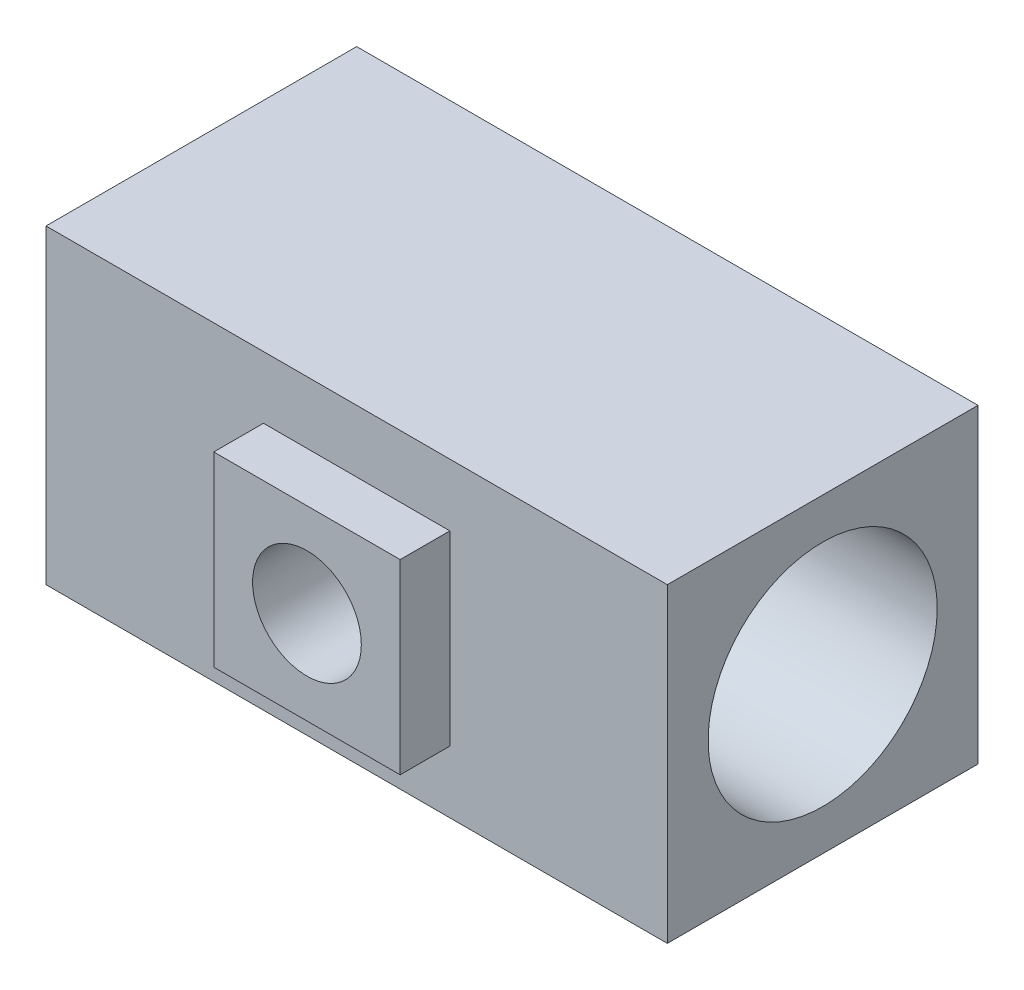
ISO-10303-21;
HEADER;
FILE_DESCRIPTION(('STEP AP214'),'2;1');
FILE_NAME('part.step','',(''),(''),'','','');
FILE_SCHEMA(('AUTOMOTIVE_DESIGN { 1 0 10303 214 1 1 1 1 }'));
ENDSEC;
DATA;
#1=APPLICATION_CONTEXT('core data for automotive mechanical design processes');
#2=APPLICATION_PROTOCOL_DEFINITION('international standard','automotive_design',2000,#1);
#3=PRODUCT_CONTEXT('',#1,'mechanical');
#4=PRODUCT('Part','Part','',(#3));
#5=PRODUCT_RELATED_PRODUCT_CATEGORY('part','',(#4));
#6=PRODUCT_DEFINITION_FORMATION('','',#4);
#7=PRODUCT_DEFINITION_CONTEXT('part definition',#1,'design');
#8=PRODUCT_DEFINITION('design','',#6,#7);
#9=PRODUCT_DEFINITION_SHAPE('','',#8);
#10=(LENGTH_UNIT() NAMED_UNIT(*) SI_UNIT(.MILLI.,.METRE.));
#11=(NAMED_UNIT(*) PLANE_ANGLE_UNIT() SI_UNIT($,.RADIAN.));
#12=(NAMED_UNIT(*) SI_UNIT($,.STERADIAN.) SOLID_ANGLE_UNIT());
#13=UNCERTAINTY_MEASURE_WITH_UNIT(LENGTH_MEASURE(1.E-05),#10,'distance_accuracy_value','');
#14=(GEOMETRIC_REPRESENTATION_CONTEXT(3) GLOBAL_UNCERTAINTY_ASSIGNED_CONTEXT((#13)) GLOBAL_UNIT_ASSIGNED_CONTEXT((#10,
#11,#12)) REPRESENTATION_CONTEXT('',''));
#15=CARTESIAN_POINT('',(0.,0.,0.));
#16=DIRECTION('',(0.,0.,1.));
#17=DIRECTION('',(1.,0.,0.));
#18=AXIS2_PLACEMENT_3D('',#15,#16,#17);
#19=CARTESIAN_POINT('',(0.,31.75,15.875));
#20=DIRECTION('',(0.,0.,-1.));
#21=DIRECTION('',(-1.,0.,0.));
#22=AXIS2_PLACEMENT_3D('',#19,#20,#21);
#23=PLANE('',#22);
#24=DIRECTION('',(1.,0.,0.));
#25=VECTOR('',#24,1.);
#26=CARTESIAN_POINT('',(0.,0.,15.875));
#27=LINE('',#26,#25);
#28=CARTESIAN_POINT('',(-31.75,0.,15.875));
#29=VERTEX_POINT('',#28);
#30=CARTESIAN_POINT('',(31.75,0.,15.875));
#31=VERTEX_POINT('',#30);
#32=EDGE_CURVE('E154',#29,#31,#27,.T.);
#33=ORIENTED_EDGE('',*,*,#32,.T.);
#34=DIRECTION('',(0.,-1.,0.));
#35=VECTOR('',#34,1.);
#36=CARTESIAN_POINT('',(31.75,31.75,15.875));
#37=LINE('',#36,#35);
#38=CARTESIAN_POINT('',(31.75,31.75,15.875));
#39=VERTEX_POINT('',#38);
#40=EDGE_CURVE('E11',#39,#31,#37,.T.);
#41=ORIENTED_EDGE('',*,*,#40,.F.);
#42=DIRECTION('',(1.,0.,0.));
#43=VECTOR('',#42,1.);
#44=CARTESIAN_POINT('',(0.,31.75,15.875));
#45=LINE('',#44,#43);
#46=CARTESIAN_POINT('',(-31.75,31.75,15.875));
#47=VERTEX_POINT('',#46);
#48=EDGE_CURVE('E155',#47,#39,#45,.T.);
#49=ORIENTED_EDGE('',*,*,#48,.F.);
#50=DIRECTION('',(0.,-1.,0.));
#51=VECTOR('',#50,1.);
#52=CARTESIAN_POINT('',(-31.75,31.75,15.875));
#53=LINE('',#52,#51);
#54=EDGE_CURVE('E171',#47,#29,#53,.T.);
#55=ORIENTED_EDGE('',*,*,#54,.T.);
#56=EDGE_LOOP('',(#33,#41,#49,#55));
#57=FACE_BOUND('',#56,.T.);
#58=DIRECTION('',(1.,0.,0.));
#59=VECTOR('',#58,1.);
#60=CARTESIAN_POINT('',(0.,6.35,15.875));
#61=LINE('',#60,#59);
#62=CARTESIAN_POINT('',(-9.525,6.35,15.875));
#63=VERTEX_POINT('',#62);
#64=CARTESIAN_POINT('',(9.525,6.35,15.875));
#65=VERTEX_POINT('',#64);
#66=EDGE_CURVE('E66',#63,#65,#61,.T.);
#67=ORIENTED_EDGE('',*,*,#66,.F.);
#68=DIRECTION('',(0.,1.,0.));
#69=VECTOR('',#68,1.);
#70=CARTESIAN_POINT('',(-9.525,0.,15.875));
#71=LINE('',#70,#69);
#72=CARTESIAN_POINT('',(-9.525,25.4,15.875));
#73=VERTEX_POINT('',#72);
#74=EDGE_CURVE('E71',#63,#73,#71,.T.);
#75=ORIENTED_EDGE('',*,*,#74,.T.);
#76=DIRECTION('',(1.,0.,0.));
#77=VECTOR('',#76,1.);
#78=CARTESIAN_POINT('',(0.,25.4,15.875));
#79=LINE('',#78,#77);
#80=CARTESIAN_POINT('',(9.525,25.4,15.875));
#81=VERTEX_POINT('',#80);
#82=EDGE_CURVE('E273',#73,#81,#79,.T.);
#83=ORIENTED_EDGE('',*,*,#82,.T.);
#84=DIRECTION('',(0.,1.,0.));
#85=VECTOR('',#84,1.);
#86=CARTESIAN_POINT('',(9.525,0.,15.875));
#87=LINE('',#86,#85);
#88=EDGE_CURVE('E262',#65,#81,#87,.T.);
#89=ORIENTED_EDGE('',*,*,#88,.F.);
#90=EDGE_LOOP('',(#67,#75,#83,#89));
#91=FACE_BOUND('',#90,.T.);
#92=ADVANCED_FACE('F45',(#57,#91),#23,.F.);
#93=CARTESIAN_POINT('',(31.75,31.75,0.));
#94=DIRECTION('',(-1.,0.,0.));
#95=DIRECTION('',(0.,0.,1.));
#96=AXIS2_PLACEMENT_3D('',#93,#94,#95);
#97=PLANE('',#96);
#98=CARTESIAN_POINT('',(31.75,15.875,0.));
#99=DIRECTION('',(1.,0.,0.));
#100=DIRECTION('',(0.,0.,-1.));
#101=AXIS2_PLACEMENT_3D('',#98,#99,#100);
#102=CIRCLE('',#101,11.707876);
#103=CARTESIAN_POINT('',(31.75,15.875,-11.707876));
#104=VERTEX_POINT('',#103);
#105=EDGE_CURVE('E140',#104,#104,#102,.T.);
#106=ORIENTED_EDGE('',*,*,#105,.F.);
#107=EDGE_LOOP('',(#106));
#108=FACE_BOUND('',#107,.T.);
#109=DIRECTION('',(0.,0.,-1.));
#110=VECTOR('',#109,1.);
#111=CARTESIAN_POINT('',(31.75,0.,0.));
#112=LINE('',#111,#110);
#113=CARTESIAN_POINT('',(31.75,0.,-15.875));
#114=VERTEX_POINT('',#113);
#115=EDGE_CURVE('E175',#31,#114,#112,.T.);
#116=ORIENTED_EDGE('',*,*,#115,.T.);
#117=DIRECTION('',(0.,-1.,0.));
#118=VECTOR('',#117,1.);
#119=CARTESIAN_POINT('',(31.75,31.75,-15.875));
#120=LINE('',#119,#118);
#121=CARTESIAN_POINT('',(31.75,31.75,-15.875));
#122=VERTEX_POINT('',#121);
#123=EDGE_CURVE('E59',#122,#114,#120,.T.);
#124=ORIENTED_EDGE('',*,*,#123,.F.);
#125=DIRECTION('',(0.,0.,-1.));
#126=VECTOR('',#125,1.);
#127=CARTESIAN_POINT('',(31.75,31.75,0.));
#128=LINE('',#127,#126);
#129=EDGE_CURVE('E159',#39,#122,#128,.T.);
#130=ORIENTED_EDGE('',*,*,#129,.F.);
#131=ORIENTED_EDGE('',*,*,#40,.T.);
#132=EDGE_LOOP('',(#116,#124,#130,#131));
#133=FACE_BOUND('',#132,.T.);
#134=ADVANCED_FACE('F198',(#108,#133),#97,.F.);
#135=CARTESIAN_POINT('',(0.,31.75,-15.875));
#136=DIRECTION('',(0.,0.,-1.));
#137=DIRECTION('',(-1.,0.,0.));
#138=AXIS2_PLACEMENT_3D('',#135,#136,#137);
#139=PLANE('',#138);
#140=DIRECTION('',(1.,0.,0.));
#141=VECTOR('',#140,1.);
#142=CARTESIAN_POINT('',(0.,0.,-15.875));
#143=LINE('',#142,#141);
#144=CARTESIAN_POINT('',(-31.75,0.,-15.875));
#145=VERTEX_POINT('',#144);
#146=EDGE_CURVE('E179',#145,#114,#143,.T.);
#147=ORIENTED_EDGE('',*,*,#146,.F.);
#148=DIRECTION('',(0.,-1.,0.));
#149=VECTOR('',#148,1.);
#150=CARTESIAN_POINT('',(-31.75,31.75,-15.875));
#151=LINE('',#150,#149);
#152=CARTESIAN_POINT('',(-31.75,31.75,-15.875));
#153=VERTEX_POINT('',#152);
#154=EDGE_CURVE('E188',#153,#145,#151,.T.);
#155=ORIENTED_EDGE('',*,*,#154,.F.);
#156=DIRECTION('',(1.,0.,0.));
#157=VECTOR('',#156,1.);
#158=CARTESIAN_POINT('',(0.,31.75,-15.875));
#159=LINE('',#158,#157);
#160=EDGE_CURVE('E163',#153,#122,#159,.T.);
#161=ORIENTED_EDGE('',*,*,#160,.T.);
#162=ORIENTED_EDGE('',*,*,#123,.T.);
#163=EDGE_LOOP('',(#147,#155,#161,#162));
#164=FACE_BOUND('',#163,.T.);
#165=ADVANCED_FACE('F195',(#164),#139,.T.);
#166=CARTESIAN_POINT('',(-31.75,31.75,0.));
#167=DIRECTION('',(-1.,0.,0.));
#168=DIRECTION('',(0.,0.,1.));
#169=AXIS2_PLACEMENT_3D('',#166,#167,#168);
#170=PLANE('',#169);
#171=CARTESIAN_POINT('',(-31.75,15.875,0.));
#172=DIRECTION('',(1.,0.,0.));
#173=DIRECTION('',(0.,0.,-1.));
#174=AXIS2_PLACEMENT_3D('',#171,#172,#173);
#175=CIRCLE('',#174,11.707876);
#176=CARTESIAN_POINT('',(-31.75,15.875,-11.707876));
#177=VERTEX_POINT('',#176);
#178=EDGE_CURVE('E145',#177,#177,#175,.T.);
#179=ORIENTED_EDGE('',*,*,#178,.T.);
#180=EDGE_LOOP('',(#179));
#181=FACE_BOUND('',#180,.T.);
#182=DIRECTION('',(0.,0.,-1.));
#183=VECTOR('',#182,1.);
#184=CARTESIAN_POINT('',(-31.75,0.,0.));
#185=LINE('',#184,#183);
#186=EDGE_CURVE('E160',#29,#145,#185,.T.);
#187=ORIENTED_EDGE('',*,*,#186,.F.);
#188=ORIENTED_EDGE('',*,*,#54,.F.);
#189=DIRECTION('',(0.,0.,-1.));
#190=VECTOR('',#189,1.);
#191=CARTESIAN_POINT('',(-31.75,31.75,0.));
#192=LINE('',#191,#190);
#193=EDGE_CURVE('E167',#47,#153,#192,.T.);
#194=ORIENTED_EDGE('',*,*,#193,.T.);
#195=ORIENTED_EDGE('',*,*,#154,.T.);
#196=EDGE_LOOP('',(#187,#188,#194,#195));
#197=FACE_BOUND('',#196,.T.);
#198=ADVANCED_FACE('F205',(#181,#197),#170,.T.);
#199=CARTESIAN_POINT('',(0.,31.75,0.));
#200=DIRECTION('',(0.,1.,0.));
#201=DIRECTION('',(0.,0.,1.));
#202=AXIS2_PLACEMENT_3D('',#199,#200,#201);
#203=PLANE('',#202);
#204=ORIENTED_EDGE('',*,*,#48,.T.);
#205=ORIENTED_EDGE('',*,*,#129,.T.);
#206=ORIENTED_EDGE('',*,*,#160,.F.);
#207=ORIENTED_EDGE('',*,*,#193,.F.);
#208=EDGE_LOOP('',(#204,#205,#206,#207));
#209=FACE_BOUND('',#208,.T.);
#210=ADVANCED_FACE('F209',(#209),#203,.T.);
#211=CARTESIAN_POINT('',(0.,0.,0.));
#212=DIRECTION('',(0.,1.,0.));
#213=DIRECTION('',(0.,0.,1.));
#214=AXIS2_PLACEMENT_3D('',#211,#212,#213);
#215=PLANE('',#214);
#216=ORIENTED_EDGE('',*,*,#32,.F.);
#217=ORIENTED_EDGE('',*,*,#186,.T.);
#218=ORIENTED_EDGE('',*,*,#146,.T.);
#219=ORIENTED_EDGE('',*,*,#115,.F.);
#220=EDGE_LOOP('',(#216,#217,#218,#219));
#221=FACE_BOUND('',#220,.T.);
#222=ADVANCED_FACE('F202',(#221),#215,.F.);
#223=CARTESIAN_POINT('',(31.75,15.875,0.));
#224=DIRECTION('',(1.,0.,0.));
#225=DIRECTION('',(0.,0.,-1.));
#226=AXIS2_PLACEMENT_3D('',#223,#224,#225);
#227=CYLINDRICAL_SURFACE('',#226,11.707876);
#228=CARTESIAN_POINT('',(5.55625,15.875,11.707876));
#229=CARTESIAN_POINT('',(5.5562490670547,16.0219956300197,11.7078751881534));
#230=CARTESIAN_POINT('',(5.55040944138286,16.1690144828683,11.7051007412646));
#231=CARTESIAN_POINT('',(5.52711300941749,16.461980757862,11.6940720886933));
#232=CARTESIAN_POINT('',(5.5096503982511,16.6079276077738,11.6858151448901));
#233=CARTESIAN_POINT('',(5.46326853428186,16.8978361602466,11.6640185894263));
#234=CARTESIAN_POINT('',(5.43433046697483,17.0417941989339,11.6504703029361));
#235=CARTESIAN_POINT('',(5.36530691071274,17.3265046320242,11.6184349778542));
#236=CARTESIAN_POINT('',(5.3252168641208,17.4672556902865,11.5999459201696));
#237=CARTESIAN_POINT('',(5.23449222101402,17.7439869649946,11.558578243056));
#238=CARTESIAN_POINT('',(5.18390260396629,17.8799847312361,11.5357183797388));
#239=CARTESIAN_POINT('',(5.07254787724768,18.1470328976869,11.4861095658599));
#240=CARTESIAN_POINT('',(5.01177894652446,18.2780814173543,11.4593591553855));
#241=CARTESIAN_POINT('',(4.81500573588385,18.6625356387209,11.374210817044));
#242=CARTESIAN_POINT('',(4.66442750006194,18.9075748322604,11.3108650175544));
#243=CARTESIAN_POINT('',(4.31931225020357,19.3830943690822,11.172846650347));
#244=CARTESIAN_POINT('',(4.12278313903047,19.6119869093358,11.0977380273396));
#245=CARTESIAN_POINT('',(3.69536606488713,20.0351137703647,10.9461555166101));
#246=CARTESIAN_POINT('',(3.46445486769873,20.2293244576388,10.8696807366803));
#247=CARTESIAN_POINT('',(3.08761306739184,20.4971802127023,10.7573275120701));
#248=CARTESIAN_POINT('',(2.95214301803387,20.5848729763442,10.7191187675812));
#249=CARTESIAN_POINT('',(2.67348841892434,20.7484420665901,10.6457475911625));
#250=CARTESIAN_POINT('',(2.53030715440833,20.8243233725001,10.6105838783407));
#251=CARTESIAN_POINT('',(2.23705973706034,20.9635981838658,10.5444999682807));
#252=CARTESIAN_POINT('',(2.08699382639768,21.0269921281533,10.5135796219335));
#253=CARTESIAN_POINT('',(1.78104248589405,21.1405868303316,10.4571497495938));
#254=CARTESIAN_POINT('',(1.62516040846482,21.190795058236,10.4316371615681));
#255=CARTESIAN_POINT('',(1.31763187169123,21.2749744066381,10.3882988077653));
#256=CARTESIAN_POINT('',(1.16624211207503,21.3097013787946,10.3701207556261));
#257=CARTESIAN_POINT('',(0.860534032998205,21.366406561334,10.3402053407049));
#258=CARTESIAN_POINT('',(0.706217237467131,21.3883912273824,10.3284647166761));
#259=CARTESIAN_POINT('',(0.395983551960721,21.4193124074155,10.3118994285777));
#260=CARTESIAN_POINT('',(0.240067452818413,21.4282550842524,10.3070714980085));
#261=CARTESIAN_POINT('',(-0.0720160121535494,21.4329741440577,10.3045278279577));
#262=CARTESIAN_POINT('',(-0.228183356988383,21.4287515752965,10.3068115222195));
#263=CARTESIAN_POINT('',(-0.522928915415686,21.408347008689,10.3177779419443));
#264=CARTESIAN_POINT('',(-0.661626198136956,21.3934723912927,10.3257608677416));
#265=CARTESIAN_POINT('',(-0.937151103292585,21.3534165957299,10.3470685065718));
#266=CARTESIAN_POINT('',(-1.07397811602019,21.3282321356429,10.3603949205636));
#267=CARTESIAN_POINT('',(-1.34479800167592,21.2678352781495,10.3919606898642));
#268=CARTESIAN_POINT('',(-1.47879133751689,21.2326245324577,10.4101992359292));
#269=CARTESIAN_POINT('',(-1.74319244552311,21.1525283471567,10.451031910625));
#270=CARTESIAN_POINT('',(-1.87359879519847,21.1076391299959,10.4736277395583));
#271=CARTESIAN_POINT('',(-2.26419153088437,20.9567618925136,10.5481218915923));
#272=CARTESIAN_POINT('',(-2.51768397132441,20.8359244835259,10.6059777720465));
#273=CARTESIAN_POINT('',(-3.00181689912236,20.5589065955817,10.7311887482533));
#274=CARTESIAN_POINT('',(-3.23244723761796,20.4027105204648,10.7985480308548));
#275=CARTESIAN_POINT('',(-3.69183766517802,20.0388318111672,10.9443811212133));
#276=CARTESIAN_POINT('',(-3.91745591328223,19.8273300013133,11.0232518530874));
#277=CARTESIAN_POINT('',(-4.33132042570187,19.3688331100084,11.1770205898922));
#278=CARTESIAN_POINT('',(-4.51955208699981,19.121824224347,11.2519170341479));
#279=CARTESIAN_POINT('',(-4.77304693768573,18.7238633432388,11.3568591982738));
#280=CARTESIAN_POINT('',(-4.85394463688191,18.5837680812418,11.3911669215658));
#281=CARTESIAN_POINT('',(-5.00352831891484,18.2963277467566,11.4557050429006));
#282=CARTESIAN_POINT('',(-5.07221939836861,18.1489857329613,11.4859371413561));
#283=CARTESIAN_POINT('',(-5.19666325541256,17.8480962418706,11.5414321496642));
#284=CARTESIAN_POINT('',(-5.2524205517506,17.6945509539284,11.5666967945522));
#285=CARTESIAN_POINT('',(-5.35037081659372,17.3823802824512,11.6115035298262));
#286=CARTESIAN_POINT('',(-5.39256517116058,17.2237554198453,11.6310462049495));
#287=CARTESIAN_POINT('',(-5.46012906456972,16.915144658783,11.662531266347));
#288=CARTESIAN_POINT('',(-5.48654457741583,16.7654350163584,11.6749432879645));
#289=CARTESIAN_POINT('',(-5.52703502689974,16.4639974931509,11.6940259057448));
#290=CARTESIAN_POINT('',(-5.5411109121972,16.312269768427,11.7006969432686));
#291=CARTESIAN_POINT('',(-5.55674296594966,16.0080771010916,11.7081079424604));
#292=CARTESIAN_POINT('',(-5.55830329883384,15.8556124205924,11.7088498769798));
#293=CARTESIAN_POINT('',(-5.54889489263416,15.5511608531681,11.704386489232));
#294=CARTESIAN_POINT('',(-5.53792660674304,15.39917394916,11.6991813820847));
#295=CARTESIAN_POINT('',(-5.50478017063363,15.1072862469522,11.6835292579519));
#296=CARTESIAN_POINT('',(-5.48342146609895,14.9672707825598,11.6734657841895));
#297=CARTESIAN_POINT('',(-5.43017825708567,14.6896460047093,11.6485505178758));
#298=CARTESIAN_POINT('',(-5.39829038796472,14.5520374752185,11.6336971947419));
#299=CARTESIAN_POINT('',(-5.32431618570488,14.2801954806572,11.599556499368));
#300=CARTESIAN_POINT('',(-5.28223290191295,14.1459610196616,11.5802704529996));
#301=CARTESIAN_POINT('',(-5.18825596784897,13.8816044140219,11.537707889774));
#302=CARTESIAN_POINT('',(-5.13635856579069,13.7514838643396,11.5144298471561));
#303=CARTESIAN_POINT('',(-4.96318183253331,13.3607701508536,11.4378578353452));
#304=CARTESIAN_POINT('',(-4.82661055341782,13.1078682024308,11.3788741108013));
#305=CARTESIAN_POINT('',(-4.5176744127763,12.6278159694376,11.251314731817));
#306=CARTESIAN_POINT('',(-4.34529386087363,12.4006770410001,11.1827348770003));
#307=CARTESIAN_POINT('',(-3.95157432883895,11.9567394277016,11.0354457403168));
#308=CARTESIAN_POINT('',(-3.7272193483145,11.7427284831527,10.9563810612571));
#309=CARTESIAN_POINT('',(-3.24503350656331,11.3542173570866,10.801883932444));
#310=CARTESIAN_POINT('',(-2.98718516943329,11.1797379333624,10.7264534072571));
#311=CARTESIAN_POINT('',(-2.57468424743307,10.9486385624648,10.6213394391657));
#312=CARTESIAN_POINT('',(-2.43010597934156,10.8757150807021,10.5871135962812));
#313=CARTESIAN_POINT('',(-2.13432111415372,10.7424705907097,10.5231630514126));
#314=CARTESIAN_POINT('',(-1.98311753499164,10.6821439151729,10.4934363269373));
#315=CARTESIAN_POINT('',(-1.67520723198086,10.5747957041115,10.4396266492068));
#316=CARTESIAN_POINT('',(-1.51850453154699,10.5277646599812,10.4155396647202));
#317=CARTESIAN_POINT('',(-1.200732092371,10.4475702205434,10.373977724913));
#318=CARTESIAN_POINT('',(-1.03966294810005,10.4144049474717,10.3565018743137));
#319=CARTESIAN_POINT('',(-0.729535200470578,10.3648238222407,10.3301998525504));
#320=CARTESIAN_POINT('',(-0.580731665939755,10.3471497022177,10.3207268309375));
#321=CARTESIAN_POINT('',(-0.281917477634769,10.3238840686606,10.3082321598221));
#322=CARTESIAN_POINT('',(-0.131906926340674,10.3182915399976,10.3052099683031));
#323=CARTESIAN_POINT('',(0.16802266851762,10.3192671483892,10.3057359057173));
#324=CARTESIAN_POINT('',(0.317941725698948,10.3258321539953,10.3092823427514));
#325=CARTESIAN_POINT('',(0.616463714308427,10.3510227316465,10.3228018711544));
#326=CARTESIAN_POINT('',(0.765066681619223,10.3696479738419,10.3327747867579));
#327=CARTESIAN_POINT('',(1.0482391987646,10.4167889819883,10.3577479846447));
#328=CARTESIAN_POINT('',(1.18299754518976,10.4444175866031,10.3722942303451));
#329=CARTESIAN_POINT('',(1.44956047189303,10.5094120483584,10.4060634326495));
#330=CARTESIAN_POINT('',(1.58136411000138,10.5467809647526,10.4252878584579));
#331=CARTESIAN_POINT('',(1.97114425759086,10.6729835373416,10.4891540771941));
#332=CARTESIAN_POINT('',(2.22367529552805,10.7759443673374,10.5400063688014));
#333=CARTESIAN_POINT('',(2.72507942902464,11.0242905995805,10.6566839522561));
#334=CARTESIAN_POINT('',(2.97258360902167,11.1720487713224,10.7232820243315));
#335=CARTESIAN_POINT('',(3.44084715370402,11.5029546897009,10.862404890388));
#336=CARTESIAN_POINT('',(3.66159354119899,11.6861194972581,10.9349325318095));
#337=CARTESIAN_POINT('',(4.09421770720619,12.1054936351878,11.0869196235712));
#338=CARTESIAN_POINT('',(4.30272081067078,12.3452558129597,11.1663058313705));
#339=CARTESIAN_POINT('',(4.58332952200995,12.7301105464011,11.2783877266976));
#340=CARTESIAN_POINT('',(4.67156770409046,12.8627174251822,11.3146091589742));
#341=CARTESIAN_POINT('',(4.83664890141032,13.1356329620851,11.3837601326838));
#342=CARTESIAN_POINT('',(4.91349716893065,13.2759380291523,11.4166911891251));
#343=CARTESIAN_POINT('',(5.05495058563346,13.5630838909267,11.4782806625807));
#344=CARTESIAN_POINT('',(5.11958252263107,13.7099094927594,11.5069483979916));
#345=CARTESIAN_POINT('',(5.23611941004082,14.0093221256557,11.5592681967573));
#346=CARTESIAN_POINT('',(5.28803056735213,14.1619063048039,11.5829227054707));
#347=CARTESIAN_POINT('',(5.37844577569775,14.4713744590327,11.624479196636));
#348=CARTESIAN_POINT('',(5.41698047331251,14.6282477051782,11.6423943211296));
#349=CARTESIAN_POINT('',(5.48028894861639,14.9452469709914,11.6719846398577));
#350=CARTESIAN_POINT('',(5.50507167626061,15.1053708046215,11.6836638922887));
#351=CARTESIAN_POINT('',(5.53394323457253,15.3673478595856,11.6973025382662));
#352=CARTESIAN_POINT('',(5.54230323419874,15.4686486587331,11.7012626723678));
#353=CARTESIAN_POINT('',(5.55345700273366,15.6716292615559,11.7065497139097));
#354=CARTESIAN_POINT('',(5.55625064540742,15.7733090737743,11.7078765616318));
#355=CARTESIAN_POINT('',(5.55625,15.875,11.707876));
#356=B_SPLINE_CURVE_WITH_KNOTS('',3,(#228,#229,#230,#231,#232,#233,#234,#235,#236,#237,#238,
#239,#240,#241,#242,#243,#244,#245,#246,#247,#248,#249,#250,#251,#252,#253,#254,#255,#256,#257,
#258,#259,#260,#261,#262,#263,#264,#265,#266,#267,#268,#269,#270,#271,#272,#273,#274,#275,#276,
#277,#278,#279,#280,#281,#282,#283,#284,#285,#286,#287,#288,#289,#290,#291,#292,#293,#294,#295,
#296,#297,#298,#299,#300,#301,#302,#303,#304,#305,#306,#307,#308,#309,#310,#311,#312,#313,#314,
#315,#316,#317,#318,#319,#320,#321,#322,#323,#324,#325,#326,#327,#328,#329,#330,#331,#332,#333,
#334,#335,#336,#337,#338,#339,#340,#341,#342,#343,#344,#345,#346,#347,#348,#349,#350,#351,#352,
#353,#354,#355),.UNSPECIFIED.,.T.,.F.,(4,2,2,2,2,2,2,2,2,2,2,2,2,2,2,2,2,2,2,2,2,2,2,2,2,2,2,2,
2,2,2,2,2,2,2,2,2,2,2,2,2,2,2,2,2,2,2,2,2,2,2,2,2,2,2,2,2,2,2,2,2,2,2,4),(0.,0.440885883860532,
0.881992124942835,1.32382458879489,1.76583788852136,2.20599533484612,2.64631837672899,
3.52593867536117,4.45490278042841,5.3844975203964,5.88148882338394,6.37827004109477,
6.87503379776749,7.37151551619725,7.84000556444114,8.30825805249056,8.77628920106892,
9.24428308405656,9.66295232634392,10.081754946899,10.5004886144467,10.9193860124707,
11.7757584217823,12.6325093022665,13.5858440188259,14.5395503741225,15.0351183045488,
15.5304788323557,16.0256660317504,16.5208026095,16.9777832881054,17.4347288313585,
17.8915223240861,18.3482992939276,18.7737833031537,19.1994034095245,19.6248963739772,
20.0505523278662,20.926784244243,21.8034009078341,22.7592085654323,23.7155169553753,
24.2114753538127,24.7072101373491,25.202589485286,25.697901725005,26.1477367393194,
26.5975339557755,27.0472153328768,27.4968844116227,27.9113955303841,28.326036996705,
29.1547601665215,30.0387912953419,30.9232494670413,31.9007316622217,32.3902826841781,
32.8796072502312,33.3678460571452,33.8558461593271,34.3427207169139,34.8292780376632,
35.1342740240184,35.4392769270546),.UNSPECIFIED.);
#357=CARTESIAN_POINT('',(5.55625,15.875,11.707876));
#358=VERTEX_POINT('',#357);
#359=EDGE_CURVE('E48',#358,#358,#356,.T.);
#360=ORIENTED_EDGE('',*,*,#359,.T.);
#361=EDGE_LOOP('',(#360));
#362=FACE_BOUND('',#361,.T.);
#363=ORIENTED_EDGE('',*,*,#178,.F.);
#364=EDGE_LOOP('',(#363));
#365=FACE_BOUND('',#364,.T.);
#366=ORIENTED_EDGE('',*,*,#105,.T.);
#367=EDGE_LOOP('',(#366));
#368=FACE_BOUND('',#367,.T.);
#369=ADVANCED_FACE('F227',(#362,#365,#368),#227,.F.);
#370=CARTESIAN_POINT('',(0.,6.35,20.955));
#371=DIRECTION('',(0.,1.,0.));
#372=DIRECTION('',(0.,0.,1.));
#373=AXIS2_PLACEMENT_3D('',#370,#371,#372);
#374=PLANE('',#373);
#375=ORIENTED_EDGE('',*,*,#66,.T.);
#376=DIRECTION('',(0.,0.,-1.));
#377=VECTOR('',#376,1.);
#378=CARTESIAN_POINT('',(9.525,6.35,20.955));
#379=LINE('',#378,#377);
#380=CARTESIAN_POINT('',(9.525,6.35,20.955));
#381=VERTEX_POINT('',#380);
#382=EDGE_CURVE('E120',#381,#65,#379,.T.);
#383=ORIENTED_EDGE('',*,*,#382,.F.);
#384=DIRECTION('',(1.,0.,0.));
#385=VECTOR('',#384,1.);
#386=CARTESIAN_POINT('',(0.,6.35,20.955));
#387=LINE('',#386,#385);
#388=CARTESIAN_POINT('',(-9.525,6.35,20.955));
#389=VERTEX_POINT('',#388);
#390=EDGE_CURVE('E128',#389,#381,#387,.T.);
#391=ORIENTED_EDGE('',*,*,#390,.F.);
#392=DIRECTION('',(0.,0.,-1.));
#393=VECTOR('',#392,1.);
#394=CARTESIAN_POINT('',(-9.525,6.35,20.955));
#395=LINE('',#394,#393);
#396=EDGE_CURVE('E269',#389,#63,#395,.T.);
#397=ORIENTED_EDGE('',*,*,#396,.T.);
#398=EDGE_LOOP('',(#375,#383,#391,#397));
#399=FACE_BOUND('',#398,.T.);
#400=ADVANCED_FACE('F138',(#399),#374,.F.);
#401=CARTESIAN_POINT('',(9.525,0.,20.955));
#402=DIRECTION('',(-1.,0.,0.));
#403=DIRECTION('',(0.,0.,1.));
#404=AXIS2_PLACEMENT_3D('',#401,#402,#403);
#405=PLANE('',#404);
#406=ORIENTED_EDGE('',*,*,#88,.T.);
#407=DIRECTION('',(0.,0.,-1.));
#408=VECTOR('',#407,1.);
#409=CARTESIAN_POINT('',(9.525,25.4,20.955));
#410=LINE('',#409,#408);
#411=CARTESIAN_POINT('',(9.525,25.4,20.955));
#412=VERTEX_POINT('',#411);
#413=EDGE_CURVE('E122',#412,#81,#410,.T.);
#414=ORIENTED_EDGE('',*,*,#413,.F.);
#415=DIRECTION('',(0.,1.,0.));
#416=VECTOR('',#415,1.);
#417=CARTESIAN_POINT('',(9.525,0.,20.955));
#418=LINE('',#417,#416);
#419=EDGE_CURVE('E115',#381,#412,#418,.T.);
#420=ORIENTED_EDGE('',*,*,#419,.F.);
#421=ORIENTED_EDGE('',*,*,#382,.T.);
#422=EDGE_LOOP('',(#406,#414,#420,#421));
#423=FACE_BOUND('',#422,.T.);
#424=ADVANCED_FACE('F118',(#423),#405,.F.);
#425=CARTESIAN_POINT('',(0.,25.4,20.955));
#426=DIRECTION('',(0.,1.,0.));
#427=DIRECTION('',(0.,0.,1.));
#428=AXIS2_PLACEMENT_3D('',#425,#426,#427);
#429=PLANE('',#428);
#430=ORIENTED_EDGE('',*,*,#82,.F.);
#431=DIRECTION('',(0.,0.,-1.));
#432=VECTOR('',#431,1.);
#433=CARTESIAN_POINT('',(-9.525,25.4,20.955));
#434=LINE('',#433,#432);
#435=CARTESIAN_POINT('',(-9.525,25.4,20.955));
#436=VERTEX_POINT('',#435);
#437=EDGE_CURVE('E147',#436,#73,#434,.T.);
#438=ORIENTED_EDGE('',*,*,#437,.F.);
#439=DIRECTION('',(1.,0.,0.));
#440=VECTOR('',#439,1.);
#441=CARTESIAN_POINT('',(0.,25.4,20.955));
#442=LINE('',#441,#440);
#443=EDGE_CURVE('E127',#436,#412,#442,.T.);
#444=ORIENTED_EDGE('',*,*,#443,.T.);
#445=ORIENTED_EDGE('',*,*,#413,.T.);
#446=EDGE_LOOP('',(#430,#438,#444,#445));
#447=FACE_BOUND('',#446,.T.);
#448=ADVANCED_FACE('F237',(#447),#429,.T.);
#449=CARTESIAN_POINT('',(-9.525,0.,20.955));
#450=DIRECTION('',(-1.,0.,0.));
#451=DIRECTION('',(0.,0.,1.));
#452=AXIS2_PLACEMENT_3D('',#449,#450,#451);
#453=PLANE('',#452);
#454=ORIENTED_EDGE('',*,*,#74,.F.);
#455=ORIENTED_EDGE('',*,*,#396,.F.);
#456=DIRECTION('',(0.,1.,0.));
#457=VECTOR('',#456,1.);
#458=CARTESIAN_POINT('',(-9.525,0.,20.955));
#459=LINE('',#458,#457);
#460=EDGE_CURVE('E134',#389,#436,#459,.T.);
#461=ORIENTED_EDGE('',*,*,#460,.T.);
#462=ORIENTED_EDGE('',*,*,#437,.T.);
#463=EDGE_LOOP('',(#454,#455,#461,#462));
#464=FACE_BOUND('',#463,.T.);
#465=ADVANCED_FACE('F240',(#464),#453,.T.);
#466=CARTESIAN_POINT('',(0.,0.,20.955));
#467=DIRECTION('',(0.,0.,1.));
#468=DIRECTION('',(1.,0.,0.));
#469=AXIS2_PLACEMENT_3D('',#466,#467,#468);
#470=PLANE('',#469);
#471=CARTESIAN_POINT('',(0.,15.875,20.955));
#472=DIRECTION('',(0.,0.,1.));
#473=DIRECTION('',(1.,0.,0.));
#474=AXIS2_PLACEMENT_3D('',#471,#472,#473);
#475=CIRCLE('',#474,5.55625);
#476=CARTESIAN_POINT('',(5.55625,15.875,20.955));
#477=VERTEX_POINT('',#476);
#478=EDGE_CURVE('E256',#477,#477,#475,.T.);
#479=ORIENTED_EDGE('',*,*,#478,.F.);
#480=EDGE_LOOP('',(#479));
#481=FACE_BOUND('',#480,.T.);
#482=ORIENTED_EDGE('',*,*,#390,.T.);
#483=ORIENTED_EDGE('',*,*,#419,.T.);
#484=ORIENTED_EDGE('',*,*,#443,.F.);
#485=ORIENTED_EDGE('',*,*,#460,.F.);
#486=EDGE_LOOP('',(#482,#483,#484,#485));
#487=FACE_BOUND('',#486,.T.);
#488=ADVANCED_FACE('F132',(#481,#487),#470,.T.);
#489=CARTESIAN_POINT('',(0.,15.875,20.955));
#490=DIRECTION('',(0.,0.,1.));
#491=DIRECTION('',(1.,0.,0.));
#492=AXIS2_PLACEMENT_3D('',#489,#490,#491);
#493=CYLINDRICAL_SURFACE('',#492,5.55625);
#494=ORIENTED_EDGE('',*,*,#478,.T.);
#495=EDGE_LOOP('',(#494));
#496=FACE_BOUND('',#495,.T.);
#497=ORIENTED_EDGE('',*,*,#359,.F.);
#498=EDGE_LOOP('',(#497));
#499=FACE_BOUND('',#498,.T.);
#500=ADVANCED_FACE('F246',(#496,#499),#493,.F.);
#501=CLOSED_SHELL('',(#92,#134,#165,#198,#210,#222,#369,#400,#424,#448,#465,#488,#500));
#502=MANIFOLD_SOLID_BREP('B2',#501);
#503=ADVANCED_BREP_SHAPE_REPRESENTATION('',(#18,#502),#14);
#504=SHAPE_DEFINITION_REPRESENTATION(#9,#503);
ENDSEC;
END-ISO-10303-21;
